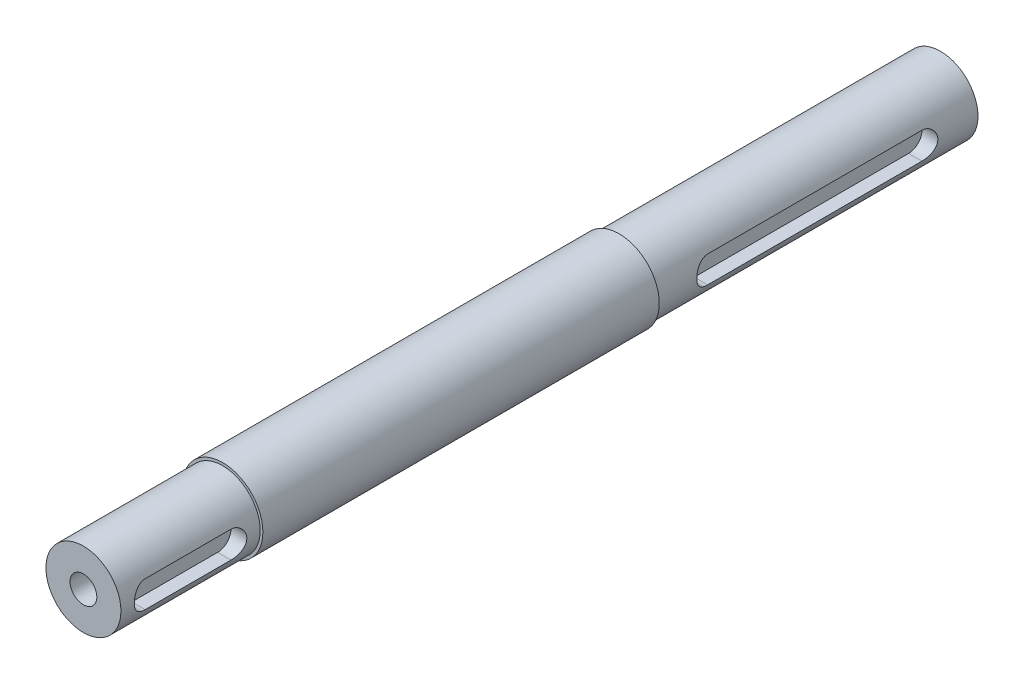
ISO-10303-21;
HEADER;
FILE_DESCRIPTION(('STEP AP214'),'2;1');
FILE_NAME('part.step','',(''),(''),'','','');
FILE_SCHEMA(('AUTOMOTIVE_DESIGN { 1 0 10303 214 1 1 1 1 }'));
ENDSEC;
DATA;
#1=APPLICATION_CONTEXT('core data for automotive mechanical design processes');
#2=APPLICATION_PROTOCOL_DEFINITION('international standard','automotive_design',2000,#1);
#3=PRODUCT_CONTEXT('',#1,'mechanical');
#4=PRODUCT('Part','Part','',(#3));
#5=PRODUCT_RELATED_PRODUCT_CATEGORY('part','',(#4));
#6=PRODUCT_DEFINITION_FORMATION('','',#4);
#7=PRODUCT_DEFINITION_CONTEXT('part definition',#1,'design');
#8=PRODUCT_DEFINITION('design','',#6,#7);
#9=PRODUCT_DEFINITION_SHAPE('','',#8);
#10=(LENGTH_UNIT() NAMED_UNIT(*) SI_UNIT(.MILLI.,.METRE.));
#11=(NAMED_UNIT(*) PLANE_ANGLE_UNIT() SI_UNIT($,.RADIAN.));
#12=(NAMED_UNIT(*) SI_UNIT($,.STERADIAN.) SOLID_ANGLE_UNIT());
#13=UNCERTAINTY_MEASURE_WITH_UNIT(LENGTH_MEASURE(1.E-05),#10,'distance_accuracy_value','');
#14=(GEOMETRIC_REPRESENTATION_CONTEXT(3) GLOBAL_UNCERTAINTY_ASSIGNED_CONTEXT((#13)) GLOBAL_UNIT_ASSIGNED_CONTEXT((#10,
#11,#12)) REPRESENTATION_CONTEXT('',''));
#15=CARTESIAN_POINT('',(0.,0.,0.));
#16=DIRECTION('',(0.,0.,1.));
#17=DIRECTION('',(1.,0.,0.));
#18=AXIS2_PLACEMENT_3D('',#15,#16,#17);
#19=CARTESIAN_POINT('',(0.,0.,134.));
#20=DIRECTION('',(0.,0.,1.));
#21=DIRECTION('',(1.,0.,0.));
#22=AXIS2_PLACEMENT_3D('',#19,#20,#21);
#23=PLANE('',#22);
#24=CARTESIAN_POINT('',(0.,0.,134.));
#25=DIRECTION('',(0.,0.,1.));
#26=DIRECTION('',(1.,0.,0.));
#27=AXIS2_PLACEMENT_3D('',#24,#25,#26);
#28=CIRCLE('',#27,7.5);
#29=CARTESIAN_POINT('',(7.5,0.,134.));
#30=VERTEX_POINT('',#29);
#31=EDGE_CURVE('E176',#30,#30,#28,.T.);
#32=ORIENTED_EDGE('',*,*,#31,.T.);
#33=EDGE_LOOP('',(#32));
#34=FACE_BOUND('',#33,.T.);
#35=CARTESIAN_POINT('',(0.,0.,134.));
#36=DIRECTION('',(0.,0.,1.));
#37=DIRECTION('',(1.,0.,0.));
#38=AXIS2_PLACEMENT_3D('',#35,#36,#37);
#39=CIRCLE('',#38,7.);
#40=CARTESIAN_POINT('',(7.,0.,134.));
#41=VERTEX_POINT('',#40);
#42=EDGE_CURVE('E165',#41,#41,#39,.T.);
#43=ORIENTED_EDGE('',*,*,#42,.F.);
#44=EDGE_LOOP('',(#43));
#45=FACE_BOUND('',#44,.T.);
#46=ADVANCED_FACE('F35',(#34,#45),#23,.T.);
#47=CARTESIAN_POINT('',(0.,0.,60.));
#48=DIRECTION('',(0.,0.,-1.));
#49=DIRECTION('',(-1.,0.,0.));
#50=AXIS2_PLACEMENT_3D('',#47,#48,#49);
#51=CYLINDRICAL_SURFACE('',#50,7.);
#52=DIRECTION('',(0.,0.,-1.));
#53=VECTOR('',#52,1.);
#54=CARTESIAN_POINT('',(6.53834841531101,-2.50000000000001,60.));
#55=LINE('',#54,#53);
#56=CARTESIAN_POINT('',(6.53834841531101,-2.5,10.));
#57=VERTEX_POINT('',#56);
#58=CARTESIAN_POINT('',(6.53834841531101,-2.50000000000001,50.));
#59=VERTEX_POINT('',#58);
#60=EDGE_CURVE('E11',#57,#59,#55,.F.);
#61=ORIENTED_EDGE('',*,*,#60,.T.);
#62=CARTESIAN_POINT('',(6.53834841531101,-2.50000000000001,50.));
#63=CARTESIAN_POINT('',(6.53833653785133,-2.50000932220904,50.0678892457289));
#64=CARTESIAN_POINT('',(6.53940549922738,-2.49723485076694,50.1357719326391));
#65=CARTESIAN_POINT('',(6.54361657478133,-2.4861910211816,50.2710039106114));
#66=CARTESIAN_POINT('',(6.54675805418062,-2.47792334551209,50.3383533586061));
#67=CARTESIAN_POINT('',(6.55501217637942,-2.456001752859,50.4718214146028));
#68=CARTESIAN_POINT('',(6.56011831705676,-2.44236559963955,50.5379433363398));
#69=CARTESIAN_POINT('',(6.57213177854175,-2.40985115466649,50.6687018351085));
#70=CARTESIAN_POINT('',(6.57903917900746,-2.39097263107436,50.7333383463124));
#71=CARTESIAN_POINT('',(6.60214934365709,-2.32673964179205,50.9242643664775));
#72=CARTESIAN_POINT('',(6.62075475340844,-2.27375112606986,51.0477904521356));
#73=CARTESIAN_POINT('',(6.6622539736071,-2.14910757865425,51.284230333128));
#74=CARTESIAN_POINT('',(6.68515090424876,-2.07743895048849,51.3971363167355));
#75=CARTESIAN_POINT('',(6.73379913792224,-1.9140257110197,51.6142152133527));
#76=CARTESIAN_POINT('',(6.75962864041371,-1.82158337146745,51.7178464751959));
#77=CARTESIAN_POINT('',(6.8105759232303,-1.62073388776331,51.9085087047164));
#78=CARTESIAN_POINT('',(6.83569357019868,-1.51232377552674,51.9955365792433));
#79=CARTESIAN_POINT('',(6.88331133279046,-1.27853915335935,52.153089855455));
#80=CARTESIAN_POINT('',(6.90570835223796,-1.15274833789186,52.2230315218605));
#81=CARTESIAN_POINT('',(6.94442357672633,-0.890250825476642,52.3405366467974));
#82=CARTESIAN_POINT('',(6.96074386585465,-0.753547890540333,52.388107779046));
#83=CARTESIAN_POINT('',(6.9849105051071,-0.47882997925618,52.4576406021824));
#84=CARTESIAN_POINT('',(6.99306594352515,-0.341079835227471,52.4805391304711));
#85=CARTESIAN_POINT('',(7.00108798053822,-0.063464305296909,52.5030684027776));
#86=CARTESIAN_POINT('',(7.00095687302702,0.0764004845074428,52.5027055860347));
#87=CARTESIAN_POINT('',(6.99262258049077,0.34759325848694,52.4792887262389));
#88=CARTESIAN_POINT('',(6.98478243583517,0.479022407078714,52.4572552058015));
#89=CARTESIAN_POINT('',(6.96237832507347,0.736175812143601,52.3928265758412));
#90=CARTESIAN_POINT('',(6.94781397899037,0.861899745780458,52.3504303156375));
#91=CARTESIAN_POINT('',(6.91316506890369,1.10616102429807,52.2459530884347));
#92=CARTESIAN_POINT('',(6.89300592164314,1.22457279066906,52.1836042850399));
#93=CARTESIAN_POINT('',(6.84923355616321,1.44953531305523,52.0412206647766));
#94=CARTESIAN_POINT('',(6.82561928959263,1.5560824517677,51.9611804762164));
#95=CARTESIAN_POINT('',(6.7759054780549,1.7603244525607,51.7806767363433));
#96=CARTESIAN_POINT('',(6.74974055843875,1.85724185700417,51.6793502768551));
#97=CARTESIAN_POINT('',(6.69890342468975,2.03299914621296,51.4616726358344));
#98=CARTESIAN_POINT('',(6.67423174765257,2.11183255456462,51.3453160948315));
#99=CARTESIAN_POINT('',(6.62877803875405,2.25049860898458,51.098057401478));
#100=CARTESIAN_POINT('',(6.60807875118994,2.30994207989625,50.9669210244946));
#101=CARTESIAN_POINT('',(6.57388213610267,2.40555439725849,50.6956351984178));
#102=CARTESIAN_POINT('',(6.56037307165054,2.44176119399954,50.555500858831));
#103=CARTESIAN_POINT('',(6.54708542245562,2.47705497148627,50.3449694557358));
#104=CARTESIAN_POINT('',(6.54382010967907,2.48565347586445,50.2762636982282));
#105=CARTESIAN_POINT('',(6.53944910829676,2.49712352174882,50.1383848358083));
#106=CARTESIAN_POINT('',(6.53834103140935,2.50000139665367,50.0692123328995));
#107=CARTESIAN_POINT('',(6.53834841531101,2.5,50.));
#108=B_SPLINE_CURVE_WITH_KNOTS('',3,(#62,#63,#64,#65,#66,#67,#68,#69,#70,#71,#72,#73,#74,#75,
#76,#77,#78,#79,#80,#81,#82,#83,#84,#85,#86,#87,#88,#89,#90,#91,#92,#93,#94,#95,#96,#97,#98,#99,
#100,#101,#102,#103,#104,#105,#106,#107),.UNSPECIFIED.,.F.,.F.,(4,2,2,2,2,2,2,2,2,2,2,2,2,2,2,2,
2,2,2,2,2,2,4),(0.,0.203591628551592,0.407120929225535,0.609982356545748,0.812852756635989,
1.21793118555513,1.6233052814847,2.04515972311929,2.4670926781184,2.9018839896556,
3.33652604665238,3.75400993940862,4.17137826416922,4.56998920861347,4.96862268086888,
5.37284909448639,5.77719841367921,6.20315837945088,6.6292706567472,7.06347329058505,
7.49696496492445,7.70468580162774,7.91217653896404),.UNSPECIFIED.);
#109=CARTESIAN_POINT('',(6.53834841531101,2.5,50.));
#110=VERTEX_POINT('',#109);
#111=EDGE_CURVE('E285',#59,#110,#108,.T.);
#112=ORIENTED_EDGE('',*,*,#111,.T.);
#113=DIRECTION('',(0.,0.,-1.));
#114=VECTOR('',#113,1.);
#115=CARTESIAN_POINT('',(6.53834841531101,2.49999999999999,60.));
#116=LINE('',#115,#114);
#117=CARTESIAN_POINT('',(6.53834841531101,2.49999999999999,10.));
#118=VERTEX_POINT('',#117);
#119=EDGE_CURVE('E44',#110,#118,#116,.T.);
#120=ORIENTED_EDGE('',*,*,#119,.T.);
#121=CARTESIAN_POINT('',(6.53834841531101,2.5,10.));
#122=CARTESIAN_POINT('',(6.53833653785133,2.50000932220903,9.93211075427107));
#123=CARTESIAN_POINT('',(6.53940549922738,2.49723485076694,9.86422806736091));
#124=CARTESIAN_POINT('',(6.54361657478134,2.4861910211816,9.72899608938859));
#125=CARTESIAN_POINT('',(6.54675805418062,2.47792334551208,9.66164664139387));
#126=CARTESIAN_POINT('',(6.55501217637942,2.45600175285899,9.52817858539721));
#127=CARTESIAN_POINT('',(6.56011831705676,2.44236559963954,9.46205666366019));
#128=CARTESIAN_POINT('',(6.57213177854175,2.40985115466648,9.33129816489153));
#129=CARTESIAN_POINT('',(6.57903917900746,2.39097263107435,9.26666165368758));
#130=CARTESIAN_POINT('',(6.6021493436571,2.32673964179204,9.07573563352248));
#131=CARTESIAN_POINT('',(6.62075475340845,2.27375112606986,8.95220954786443));
#132=CARTESIAN_POINT('',(6.6622539736071,2.14910757865425,8.71576966687203));
#133=CARTESIAN_POINT('',(6.68515090424876,2.07743895048849,8.60286368326448));
#134=CARTESIAN_POINT('',(6.73379913792224,1.91402571101969,8.38578478664729));
#135=CARTESIAN_POINT('',(6.75962864041371,1.82158337146744,8.28215352480412));
#136=CARTESIAN_POINT('',(6.81057592323031,1.6207338877633,8.09149129528357));
#137=CARTESIAN_POINT('',(6.83569357019868,1.51232377552673,8.00446342075665));
#138=CARTESIAN_POINT('',(6.88331133279046,1.27853915335934,7.84691014454501));
#139=CARTESIAN_POINT('',(6.90570835223797,1.15274833789185,7.77696847813946));
#140=CARTESIAN_POINT('',(6.94442357672633,0.890250825476632,7.6594633532026));
#141=CARTESIAN_POINT('',(6.96074386585465,0.753547890540324,7.61189222095399));
#142=CARTESIAN_POINT('',(6.9849105051071,0.478829979256173,7.54235939781764));
#143=CARTESIAN_POINT('',(6.99306594352515,0.341079835227464,7.51946086952892));
#144=CARTESIAN_POINT('',(7.00108798053822,0.0634643052969017,7.49693159722236));
#145=CARTESIAN_POINT('',(7.00095687302702,-0.0764004845074502,7.49729441396535));
#146=CARTESIAN_POINT('',(6.99262258049077,-0.347593258486947,7.52071127376112));
#147=CARTESIAN_POINT('',(6.98478243583516,-0.479022407078722,7.54274479419853));
#148=CARTESIAN_POINT('',(6.96237832507347,-0.736175812143609,7.60717342415881));
#149=CARTESIAN_POINT('',(6.94781397899037,-0.861899745780465,7.64956968436252));
#150=CARTESIAN_POINT('',(6.91316506890369,-1.10616102429807,7.75404691156532));
#151=CARTESIAN_POINT('',(6.89300592164314,-1.22457279066906,7.81639571496012));
#152=CARTESIAN_POINT('',(6.8492335561632,-1.44953531305523,7.95877933522336));
#153=CARTESIAN_POINT('',(6.82561928959263,-1.55608245176771,8.0388195237836));
#154=CARTESIAN_POINT('',(6.7759054780549,-1.7603244525607,8.2193232636567));
#155=CARTESIAN_POINT('',(6.74974055843875,-1.85724185700418,8.3206497231449));
#156=CARTESIAN_POINT('',(6.69890342468975,-2.03299914621296,8.53832736416557));
#157=CARTESIAN_POINT('',(6.67423174765257,-2.11183255456462,8.65468390516847));
#158=CARTESIAN_POINT('',(6.62877803875405,-2.25049860898459,8.90194259852198));
#159=CARTESIAN_POINT('',(6.60807875118994,-2.30994207989626,9.03307897550541));
#160=CARTESIAN_POINT('',(6.57388213610267,-2.4055543972585,9.30436480158219));
#161=CARTESIAN_POINT('',(6.56037307165053,-2.44176119399954,9.44449914116898));
#162=CARTESIAN_POINT('',(6.54708542245562,-2.47705497148627,9.65503054426421));
#163=CARTESIAN_POINT('',(6.54382010967907,-2.48565347586445,9.72373630177179));
#164=CARTESIAN_POINT('',(6.53944910829676,-2.49712352174882,9.86161516419169));
#165=CARTESIAN_POINT('',(6.53834103140935,-2.50000139665367,9.93078766710051));
#166=CARTESIAN_POINT('',(6.53834841531101,-2.5,10.));
#167=B_SPLINE_CURVE_WITH_KNOTS('',3,(#121,#122,#123,#124,#125,#126,#127,#128,#129,#130,#131,
#132,#133,#134,#135,#136,#137,#138,#139,#140,#141,#142,#143,#144,#145,#146,#147,#148,#149,#150,
#151,#152,#153,#154,#155,#156,#157,#158,#159,#160,#161,#162,#163,#164,#165,#166),.UNSPECIFIED.,
.F.,.F.,(4,2,2,2,2,2,2,2,2,2,2,2,2,2,2,2,2,2,2,2,2,2,4),(0.,0.203591628551591,0.407120929225529,
0.609982356545743,0.812852756635989,1.21793118555512,1.6233052814847,2.0451597231193,
2.4670926781184,2.90188398965561,3.33652604665238,3.75400993940861,4.17137826416922,
4.56998920861347,4.96862268086888,5.37284909448639,5.77719841367921,6.20315837945088,
6.6292706567472,7.06347329058504,7.49696496492444,7.70468580162772,7.91217653896403),.UNSPECIFIED.);
#168=EDGE_CURVE('E51',#118,#57,#167,.T.);
#169=ORIENTED_EDGE('',*,*,#168,.T.);
#170=EDGE_LOOP('',(#61,#112,#120,#169));
#171=FACE_BOUND('',#170,.T.);
#172=CARTESIAN_POINT('',(0.,0.,60.));
#173=DIRECTION('',(0.,0.,1.));
#174=DIRECTION('',(1.,0.,0.));
#175=AXIS2_PLACEMENT_3D('',#172,#173,#174);
#176=CIRCLE('',#175,7.);
#177=CARTESIAN_POINT('',(7.,0.,60.));
#178=VERTEX_POINT('',#177);
#179=EDGE_CURVE('E185',#178,#178,#176,.T.);
#180=ORIENTED_EDGE('',*,*,#179,.F.);
#181=EDGE_LOOP('',(#180));
#182=FACE_BOUND('',#181,.T.);
#183=CARTESIAN_POINT('',(0.,0.,0.));
#184=DIRECTION('',(0.,0.,1.));
#185=DIRECTION('',(1.,0.,0.));
#186=AXIS2_PLACEMENT_3D('',#183,#184,#185);
#187=CIRCLE('',#186,7.);
#188=CARTESIAN_POINT('',(7.,0.,0.));
#189=VERTEX_POINT('',#188);
#190=EDGE_CURVE('E184',#189,#189,#187,.T.);
#191=ORIENTED_EDGE('',*,*,#190,.T.);
#192=EDGE_LOOP('',(#191));
#193=FACE_BOUND('',#192,.T.);
#194=ADVANCED_FACE('F37',(#171,#182,#193),#51,.T.);
#195=CARTESIAN_POINT('',(0.,0.,0.));
#196=DIRECTION('',(0.,0.,1.));
#197=DIRECTION('',(1.,0.,0.));
#198=AXIS2_PLACEMENT_3D('',#195,#196,#197);
#199=PLANE('',#198);
#200=CARTESIAN_POINT('',(0.,0.,0.));
#201=DIRECTION('',(0.,0.,-1.));
#202=DIRECTION('',(-1.,0.,0.));
#203=AXIS2_PLACEMENT_3D('',#200,#201,#202);
#204=CIRCLE('',#203,2.5);
#205=CARTESIAN_POINT('',(-2.5,0.,0.));
#206=VERTEX_POINT('',#205);
#207=EDGE_CURVE('E117',#206,#206,#204,.T.);
#208=ORIENTED_EDGE('',*,*,#207,.F.);
#209=EDGE_LOOP('',(#208));
#210=FACE_BOUND('',#209,.T.);
#211=ORIENTED_EDGE('',*,*,#190,.F.);
#212=EDGE_LOOP('',(#211));
#213=FACE_BOUND('',#212,.T.);
#214=ADVANCED_FACE('F237',(#210,#213),#199,.F.);
#215=CARTESIAN_POINT('',(0.,0.,60.));
#216=DIRECTION('',(0.,0.,1.));
#217=DIRECTION('',(1.,0.,0.));
#218=AXIS2_PLACEMENT_3D('',#215,#216,#217);
#219=PLANE('',#218);
#220=CARTESIAN_POINT('',(0.,0.,60.));
#221=DIRECTION('',(0.,0.,1.));
#222=DIRECTION('',(1.,0.,0.));
#223=AXIS2_PLACEMENT_3D('',#220,#221,#222);
#224=CIRCLE('',#223,7.5);
#225=CARTESIAN_POINT('',(7.5,0.,60.));
#226=VERTEX_POINT('',#225);
#227=EDGE_CURVE('E181',#226,#226,#224,.T.);
#228=ORIENTED_EDGE('',*,*,#227,.F.);
#229=EDGE_LOOP('',(#228));
#230=FACE_BOUND('',#229,.T.);
#231=ORIENTED_EDGE('',*,*,#179,.T.);
#232=EDGE_LOOP('',(#231));
#233=FACE_BOUND('',#232,.T.);
#234=ADVANCED_FACE('F241',(#230,#233),#219,.F.);
#235=CARTESIAN_POINT('',(0.,0.,122.));
#236=DIRECTION('',(0.,0.,-1.));
#237=DIRECTION('',(-1.,0.,0.));
#238=AXIS2_PLACEMENT_3D('',#235,#236,#237);
#239=CYLINDRICAL_SURFACE('',#238,7.5);
#240=ORIENTED_EDGE('',*,*,#227,.T.);
#241=EDGE_LOOP('',(#240));
#242=FACE_BOUND('',#241,.T.);
#243=ORIENTED_EDGE('',*,*,#31,.F.);
#244=EDGE_LOOP('',(#243));
#245=FACE_BOUND('',#244,.T.);
#246=ADVANCED_FACE('F228',(#242,#245),#239,.T.);
#247=CARTESIAN_POINT('',(0.,0.,160.));
#248=DIRECTION('',(0.,0.,-1.));
#249=DIRECTION('',(-1.,0.,0.));
#250=AXIS2_PLACEMENT_3D('',#247,#248,#249);
#251=CYLINDRICAL_SURFACE('',#250,7.);
#252=DIRECTION('',(0.,0.,-1.));
#253=VECTOR('',#252,1.);
#254=CARTESIAN_POINT('',(6.53834841531101,2.5,160.));
#255=LINE('',#254,#253);
#256=CARTESIAN_POINT('',(6.53834841531101,2.5,155.));
#257=VERTEX_POINT('',#256);
#258=CARTESIAN_POINT('',(6.53834841531101,2.5,139.));
#259=VERTEX_POINT('',#258);
#260=EDGE_CURVE('E292',#257,#259,#255,.T.);
#261=ORIENTED_EDGE('',*,*,#260,.T.);
#262=CARTESIAN_POINT('',(6.53834841531101,2.5,139.));
#263=CARTESIAN_POINT('',(6.53833653785133,2.50000932220903,138.932110754271));
#264=CARTESIAN_POINT('',(6.53940549922738,2.49723485076694,138.864228067361));
#265=CARTESIAN_POINT('',(6.54361657478134,2.4861910211816,138.728996089389));
#266=CARTESIAN_POINT('',(6.54675805418062,2.47792334551208,138.661646641394));
#267=CARTESIAN_POINT('',(6.55501217637942,2.456001752859,138.528178585397));
#268=CARTESIAN_POINT('',(6.56011831705676,2.44236559963955,138.46205666366));
#269=CARTESIAN_POINT('',(6.57213177854175,2.40985115466648,138.331298164892));
#270=CARTESIAN_POINT('',(6.57903917900746,2.39097263107436,138.266661653688));
#271=CARTESIAN_POINT('',(6.60214934365709,2.32673964179205,138.075735633523));
#272=CARTESIAN_POINT('',(6.62075475340844,2.27375112606987,137.952209547864));
#273=CARTESIAN_POINT('',(6.6622539736071,2.14910757865425,137.715769666872));
#274=CARTESIAN_POINT('',(6.68515090424876,2.07743895048849,137.602863683265));
#275=CARTESIAN_POINT('',(6.73379913792224,1.9140257110197,137.385784786647));
#276=CARTESIAN_POINT('',(6.75962864041371,1.82158337146744,137.282153524804));
#277=CARTESIAN_POINT('',(6.81057592323031,1.6207338877633,137.091491295284));
#278=CARTESIAN_POINT('',(6.83569357019868,1.51232377552674,137.004463420757));
#279=CARTESIAN_POINT('',(6.88331133279046,1.27853915335935,136.846910144545));
#280=CARTESIAN_POINT('',(6.90570835223797,1.15274833789186,136.776968478139));
#281=CARTESIAN_POINT('',(6.94442357672633,0.890250825476646,136.659463353203));
#282=CARTESIAN_POINT('',(6.96074386585465,0.75354789054034,136.611892220954));
#283=CARTESIAN_POINT('',(6.9849105051071,0.478829979256191,136.542359397818));
#284=CARTESIAN_POINT('',(6.99306594352515,0.341079835227484,136.519460869529));
#285=CARTESIAN_POINT('',(7.00108798053822,0.0634643052969198,136.496931597222));
#286=CARTESIAN_POINT('',(7.00095687302702,-0.076400484507434,136.497294413965));
#287=CARTESIAN_POINT('',(6.99262258049077,-0.347593258486933,136.520711273761));
#288=CARTESIAN_POINT('',(6.98478243583517,-0.479022407078707,136.542744794199));
#289=CARTESIAN_POINT('',(6.96237832507347,-0.736175812143594,136.607173424159));
#290=CARTESIAN_POINT('',(6.94781397899037,-0.86189974578045,136.649569684363));
#291=CARTESIAN_POINT('',(6.91316506890369,-1.10616102429805,136.754046911565));
#292=CARTESIAN_POINT('',(6.89300592164314,-1.22457279066904,136.81639571496));
#293=CARTESIAN_POINT('',(6.84923355616321,-1.44953531305521,136.958779335223));
#294=CARTESIAN_POINT('',(6.82561928959264,-1.55608245176768,137.038819523784));
#295=CARTESIAN_POINT('',(6.7759054780549,-1.76032445256068,137.219323263657));
#296=CARTESIAN_POINT('',(6.74974055843876,-1.85724185700416,137.320649723145));
#297=CARTESIAN_POINT('',(6.69890342468976,-2.03299914621295,137.538327364166));
#298=CARTESIAN_POINT('',(6.67423174765257,-2.11183255456461,137.654683905168));
#299=CARTESIAN_POINT('',(6.62877803875405,-2.25049860898458,137.901942598522));
#300=CARTESIAN_POINT('',(6.60807875118995,-2.30994207989624,138.033078975505));
#301=CARTESIAN_POINT('',(6.57388213610267,-2.40555439725849,138.304364801582));
#302=CARTESIAN_POINT('',(6.56037307165054,-2.44176119399953,138.444499141169));
#303=CARTESIAN_POINT('',(6.54708542245562,-2.47705497148627,138.655030544264));
#304=CARTESIAN_POINT('',(6.54382010967907,-2.48565347586445,138.723736301772));
#305=CARTESIAN_POINT('',(6.53944910829676,-2.49712352174882,138.861615164192));
#306=CARTESIAN_POINT('',(6.53834103140935,-2.50000139665368,138.930787667101));
#307=CARTESIAN_POINT('',(6.53834841531101,-2.5,139.));
#308=B_SPLINE_CURVE_WITH_KNOTS('',3,(#262,#263,#264,#265,#266,#267,#268,#269,#270,#271,#272,
#273,#274,#275,#276,#277,#278,#279,#280,#281,#282,#283,#284,#285,#286,#287,#288,#289,#290,#291,
#292,#293,#294,#295,#296,#297,#298,#299,#300,#301,#302,#303,#304,#305,#306,#307),.UNSPECIFIED.,
.F.,.F.,(4,2,2,2,2,2,2,2,2,2,2,2,2,2,2,2,2,2,2,2,2,2,4),(0.,0.203591628551585,0.407120929225507,
0.609982356545727,0.812852756635974,1.21793118555512,1.62330528148469,2.0451597231193,
2.46709267811838,2.9018839896556,3.33652604665236,3.7540099394086,4.17137826416921,
4.56998920861346,4.96862268086886,5.37284909448636,5.7771984136792,6.20315837945086,
6.62927065674717,7.06347329058501,7.49696496492443,7.70468580162773,7.91217653896406),.UNSPECIFIED.);
#309=CARTESIAN_POINT('',(6.53834841531101,-2.5,139.));
#310=VERTEX_POINT('',#309);
#311=EDGE_CURVE('E188',#259,#310,#308,.T.);
#312=ORIENTED_EDGE('',*,*,#311,.T.);
#313=DIRECTION('',(0.,0.,-1.));
#314=VECTOR('',#313,1.);
#315=CARTESIAN_POINT('',(6.53834841531101,-2.5,160.));
#316=LINE('',#315,#314);
#317=CARTESIAN_POINT('',(6.53834841531101,-2.5,155.));
#318=VERTEX_POINT('',#317);
#319=EDGE_CURVE('E307',#310,#318,#316,.F.);
#320=ORIENTED_EDGE('',*,*,#319,.T.);
#321=CARTESIAN_POINT('',(6.53834841531101,-2.5,155.));
#322=CARTESIAN_POINT('',(6.53833653785133,-2.50000932220903,155.067889245729));
#323=CARTESIAN_POINT('',(6.53940549922738,-2.49723485076694,155.135771932639));
#324=CARTESIAN_POINT('',(6.54361657478133,-2.4861910211816,155.271003910611));
#325=CARTESIAN_POINT('',(6.54675805418062,-2.47792334551209,155.338353358606));
#326=CARTESIAN_POINT('',(6.55501217637942,-2.45600175285901,155.471821414603));
#327=CARTESIAN_POINT('',(6.56011831705675,-2.44236559963956,155.53794333634));
#328=CARTESIAN_POINT('',(6.57213177854174,-2.4098511546665,155.668701835108));
#329=CARTESIAN_POINT('',(6.57903917900746,-2.39097263107437,155.733338346312));
#330=CARTESIAN_POINT('',(6.60214934365709,-2.32673964179205,155.924264366478));
#331=CARTESIAN_POINT('',(6.62075475340844,-2.27375112606987,156.047790452136));
#332=CARTESIAN_POINT('',(6.6622539736071,-2.14910757865425,156.284230333128));
#333=CARTESIAN_POINT('',(6.68515090424876,-2.07743895048849,156.397136316736));
#334=CARTESIAN_POINT('',(6.73379913792224,-1.9140257110197,156.614215213353));
#335=CARTESIAN_POINT('',(6.75962864041371,-1.82158337146744,156.717846475196));
#336=CARTESIAN_POINT('',(6.8105759232303,-1.62073388776331,156.908508704716));
#337=CARTESIAN_POINT('',(6.83569357019868,-1.51232377552674,156.995536579243));
#338=CARTESIAN_POINT('',(6.88331133279046,-1.27853915335936,157.153089855455));
#339=CARTESIAN_POINT('',(6.90570835223796,-1.15274833789187,157.223031521861));
#340=CARTESIAN_POINT('',(6.94442357672633,-0.890250825476652,157.340536646797));
#341=CARTESIAN_POINT('',(6.96074386585465,-0.753547890540343,157.388107779046));
#342=CARTESIAN_POINT('',(6.9849105051071,-0.47882997925619,157.457640602182));
#343=CARTESIAN_POINT('',(6.99306594352515,-0.341079835227481,157.480539130471));
#344=CARTESIAN_POINT('',(7.00108798053822,-0.0634643052969172,157.503068402778));
#345=CARTESIAN_POINT('',(7.00095687302702,0.0764004845074361,157.502705586035));
#346=CARTESIAN_POINT('',(6.99262258049077,0.347593258486934,157.479288726239));
#347=CARTESIAN_POINT('',(6.98478243583517,0.479022407078707,157.457255205801));
#348=CARTESIAN_POINT('',(6.96237832507347,0.736175812143595,157.392826575841));
#349=CARTESIAN_POINT('',(6.94781397899037,0.861899745780453,157.350430315638));
#350=CARTESIAN_POINT('',(6.91316506890369,1.10616102429806,157.245953088435));
#351=CARTESIAN_POINT('',(6.89300592164314,1.22457279066905,157.18360428504));
#352=CARTESIAN_POINT('',(6.84923355616321,1.44953531305522,157.041220664777));
#353=CARTESIAN_POINT('',(6.82561928959263,1.55608245176769,156.961180476216));
#354=CARTESIAN_POINT('',(6.7759054780549,1.76032445256068,156.780676736343));
#355=CARTESIAN_POINT('',(6.74974055843876,1.85724185700416,156.679350276855));
#356=CARTESIAN_POINT('',(6.69890342468976,2.03299914621295,156.461672635834));
#357=CARTESIAN_POINT('',(6.67423174765257,2.11183255456461,156.345316094832));
#358=CARTESIAN_POINT('',(6.62877803875405,2.25049860898458,156.098057401478));
#359=CARTESIAN_POINT('',(6.60807875118995,2.30994207989624,155.966921024495));
#360=CARTESIAN_POINT('',(6.57388213610267,2.40555439725849,155.695635198418));
#361=CARTESIAN_POINT('',(6.56037307165054,2.44176119399953,155.555500858831));
#362=CARTESIAN_POINT('',(6.54708542245562,2.47705497148627,155.344969455736));
#363=CARTESIAN_POINT('',(6.54382010967907,2.48565347586445,155.276263698228));
#364=CARTESIAN_POINT('',(6.53944910829676,2.49712352174882,155.138384835808));
#365=CARTESIAN_POINT('',(6.53834103140935,2.50000139665368,155.069212332899));
#366=CARTESIAN_POINT('',(6.53834841531101,2.5,155.));
#367=B_SPLINE_CURVE_WITH_KNOTS('',3,(#321,#322,#323,#324,#325,#326,#327,#328,#329,#330,#331,
#332,#333,#334,#335,#336,#337,#338,#339,#340,#341,#342,#343,#344,#345,#346,#347,#348,#349,#350,
#351,#352,#353,#354,#355,#356,#357,#358,#359,#360,#361,#362,#363,#364,#365,#366),.UNSPECIFIED.,
.F.,.F.,(4,2,2,2,2,2,2,2,2,2,2,2,2,2,2,2,2,2,2,2,2,2,4),(0.,0.203591628551557,0.407120929225478,
0.609982356545669,0.812852756635974,1.21793118555512,1.62330528148469,2.04515972311928,
2.46709267811838,2.90188398965559,3.33652604665236,3.7540099394086,4.17137826416921,
4.56998920861346,4.96862268086886,5.37284909448638,5.7771984136792,6.20315837945085,
6.62927065674716,7.06347329058501,7.49696496492443,7.70468580162773,7.91217653896406),.UNSPECIFIED.);
#368=EDGE_CURVE('E59',#318,#257,#367,.T.);
#369=ORIENTED_EDGE('',*,*,#368,.T.);
#370=EDGE_LOOP('',(#261,#312,#320,#369));
#371=FACE_BOUND('',#370,.T.);
#372=CARTESIAN_POINT('',(0.,0.,160.));
#373=DIRECTION('',(0.,0.,1.));
#374=DIRECTION('',(1.,0.,0.));
#375=AXIS2_PLACEMENT_3D('',#372,#373,#374);
#376=CIRCLE('',#375,7.);
#377=CARTESIAN_POINT('',(7.,0.,160.));
#378=VERTEX_POINT('',#377);
#379=EDGE_CURVE('E173',#378,#378,#376,.T.);
#380=ORIENTED_EDGE('',*,*,#379,.F.);
#381=EDGE_LOOP('',(#380));
#382=FACE_BOUND('',#381,.T.);
#383=ORIENTED_EDGE('',*,*,#42,.T.);
#384=EDGE_LOOP('',(#383));
#385=FACE_BOUND('',#384,.T.);
#386=ADVANCED_FACE('F203',(#371,#382,#385),#251,.T.);
#387=CARTESIAN_POINT('',(0.,0.,160.));
#388=DIRECTION('',(0.,0.,1.));
#389=DIRECTION('',(1.,0.,0.));
#390=AXIS2_PLACEMENT_3D('',#387,#388,#389);
#391=PLANE('',#390);
#392=CARTESIAN_POINT('',(0.,0.,160.));
#393=DIRECTION('',(0.,0.,1.));
#394=DIRECTION('',(1.,0.,0.));
#395=AXIS2_PLACEMENT_3D('',#392,#393,#394);
#396=CIRCLE('',#395,2.49999999999999);
#397=CARTESIAN_POINT('',(2.49999999999999,0.,160.));
#398=VERTEX_POINT('',#397);
#399=EDGE_CURVE('E118',#398,#398,#396,.T.);
#400=ORIENTED_EDGE('',*,*,#399,.F.);
#401=EDGE_LOOP('',(#400));
#402=FACE_BOUND('',#401,.T.);
#403=ORIENTED_EDGE('',*,*,#379,.T.);
#404=EDGE_LOOP('',(#403));
#405=FACE_BOUND('',#404,.T.);
#406=ADVANCED_FACE('F222',(#402,#405),#391,.T.);
#407=CARTESIAN_POINT('',(4.04,0.,155.));
#408=DIRECTION('',(1.,0.,0.));
#409=DIRECTION('',(0.,0.,-1.));
#410=AXIS2_PLACEMENT_3D('',#407,#408,#409);
#411=CYLINDRICAL_SURFACE('',#410,2.5);
#412=DIRECTION('',(1.,0.,0.));
#413=VECTOR('',#412,1.);
#414=CARTESIAN_POINT('',(4.04,-2.5,155.));
#415=LINE('',#414,#413);
#416=CARTESIAN_POINT('',(4.04,-2.5,155.));
#417=VERTEX_POINT('',#416);
#418=EDGE_CURVE('E162',#417,#318,#415,.T.);
#419=ORIENTED_EDGE('',*,*,#418,.F.);
#420=CARTESIAN_POINT('',(4.04,0.,155.));
#421=DIRECTION('',(1.,0.,0.));
#422=DIRECTION('',(0.,0.,-1.));
#423=AXIS2_PLACEMENT_3D('',#420,#421,#422);
#424=CIRCLE('',#423,2.5);
#425=CARTESIAN_POINT('',(4.04,2.5,155.));
#426=VERTEX_POINT('',#425);
#427=EDGE_CURVE('E143',#426,#417,#424,.T.);
#428=ORIENTED_EDGE('',*,*,#427,.F.);
#429=DIRECTION('',(1.,0.,0.));
#430=VECTOR('',#429,1.);
#431=CARTESIAN_POINT('',(4.04,2.5,155.));
#432=LINE('',#431,#430);
#433=EDGE_CURVE('E163',#426,#257,#432,.T.);
#434=ORIENTED_EDGE('',*,*,#433,.T.);
#435=ORIENTED_EDGE('',*,*,#368,.F.);
#436=EDGE_LOOP('',(#419,#428,#434,#435));
#437=FACE_BOUND('',#436,.T.);
#438=ADVANCED_FACE('F219',(#437),#411,.F.);
#439=CARTESIAN_POINT('',(4.04,2.5,155.));
#440=DIRECTION('',(0.,1.,0.));
#441=DIRECTION('',(0.,0.,1.));
#442=AXIS2_PLACEMENT_3D('',#439,#440,#441);
#443=PLANE('',#442);
#444=ORIENTED_EDGE('',*,*,#433,.F.);
#445=DIRECTION('',(0.,0.,1.));
#446=VECTOR('',#445,1.);
#447=CARTESIAN_POINT('',(4.04,2.5,155.));
#448=LINE('',#447,#446);
#449=CARTESIAN_POINT('',(4.04,2.5,139.));
#450=VERTEX_POINT('',#449);
#451=EDGE_CURVE('E159',#450,#426,#448,.T.);
#452=ORIENTED_EDGE('',*,*,#451,.F.);
#453=DIRECTION('',(1.,0.,0.));
#454=VECTOR('',#453,1.);
#455=CARTESIAN_POINT('',(4.04,2.5,139.));
#456=LINE('',#455,#454);
#457=EDGE_CURVE('E166',#450,#259,#456,.T.);
#458=ORIENTED_EDGE('',*,*,#457,.T.);
#459=ORIENTED_EDGE('',*,*,#260,.F.);
#460=EDGE_LOOP('',(#444,#452,#458,#459));
#461=FACE_BOUND('',#460,.T.);
#462=ADVANCED_FACE('F213',(#461),#443,.F.);
#463=CARTESIAN_POINT('',(4.04,0.,139.));
#464=DIRECTION('',(1.,0.,0.));
#465=DIRECTION('',(0.,0.,-1.));
#466=AXIS2_PLACEMENT_3D('',#463,#464,#465);
#467=CYLINDRICAL_SURFACE('',#466,2.5);
#468=ORIENTED_EDGE('',*,*,#457,.F.);
#469=CARTESIAN_POINT('',(4.04,0.,139.));
#470=DIRECTION('',(1.,0.,0.));
#471=DIRECTION('',(0.,0.,-1.));
#472=AXIS2_PLACEMENT_3D('',#469,#470,#471);
#473=CIRCLE('',#472,2.5);
#474=CARTESIAN_POINT('',(4.04,-2.5,139.));
#475=VERTEX_POINT('',#474);
#476=EDGE_CURVE('E156',#475,#450,#473,.T.);
#477=ORIENTED_EDGE('',*,*,#476,.F.);
#478=DIRECTION('',(1.,0.,0.));
#479=VECTOR('',#478,1.);
#480=CARTESIAN_POINT('',(4.04,-2.5,139.));
#481=LINE('',#480,#479);
#482=EDGE_CURVE('E169',#475,#310,#481,.T.);
#483=ORIENTED_EDGE('',*,*,#482,.T.);
#484=ORIENTED_EDGE('',*,*,#311,.F.);
#485=EDGE_LOOP('',(#468,#477,#483,#484));
#486=FACE_BOUND('',#485,.T.);
#487=ADVANCED_FACE('F207',(#486),#467,.F.);
#488=CARTESIAN_POINT('',(4.04,-2.5,155.));
#489=DIRECTION('',(0.,-1.,0.));
#490=DIRECTION('',(0.,0.,-1.));
#491=AXIS2_PLACEMENT_3D('',#488,#489,#490);
#492=PLANE('',#491);
#493=ORIENTED_EDGE('',*,*,#482,.F.);
#494=DIRECTION('',(0.,0.,-1.));
#495=VECTOR('',#494,1.);
#496=CARTESIAN_POINT('',(4.04,-2.5,155.));
#497=LINE('',#496,#495);
#498=EDGE_CURVE('E153',#417,#475,#497,.T.);
#499=ORIENTED_EDGE('',*,*,#498,.F.);
#500=ORIENTED_EDGE('',*,*,#418,.T.);
#501=ORIENTED_EDGE('',*,*,#319,.F.);
#502=EDGE_LOOP('',(#493,#499,#500,#501));
#503=FACE_BOUND('',#502,.T.);
#504=ADVANCED_FACE('F212',(#503),#492,.F.);
#505=CARTESIAN_POINT('',(4.04,0.,155.));
#506=DIRECTION('',(1.,0.,0.));
#507=DIRECTION('',(0.,0.,-1.));
#508=AXIS2_PLACEMENT_3D('',#505,#506,#507);
#509=PLANE('',#508);
#510=ORIENTED_EDGE('',*,*,#427,.T.);
#511=ORIENTED_EDGE('',*,*,#498,.T.);
#512=ORIENTED_EDGE('',*,*,#476,.T.);
#513=ORIENTED_EDGE('',*,*,#451,.T.);
#514=EDGE_LOOP('',(#510,#511,#512,#513));
#515=FACE_BOUND('',#514,.T.);
#516=ADVANCED_FACE('F217',(#515),#509,.T.);
#517=CARTESIAN_POINT('',(4.04,0.,10.));
#518=DIRECTION('',(1.,0.,0.));
#519=DIRECTION('',(0.,0.,-1.));
#520=AXIS2_PLACEMENT_3D('',#517,#518,#519);
#521=CYLINDRICAL_SURFACE('',#520,2.5);
#522=DIRECTION('',(1.,0.,0.));
#523=VECTOR('',#522,1.);
#524=CARTESIAN_POINT('',(4.04,2.5,10.));
#525=LINE('',#524,#523);
#526=CARTESIAN_POINT('',(4.04,2.5,10.));
#527=VERTEX_POINT('',#526);
#528=EDGE_CURVE('E140',#527,#118,#525,.T.);
#529=ORIENTED_EDGE('',*,*,#528,.F.);
#530=CARTESIAN_POINT('',(4.04,0.,10.));
#531=DIRECTION('',(1.,0.,0.));
#532=DIRECTION('',(0.,0.,-1.));
#533=AXIS2_PLACEMENT_3D('',#530,#531,#532);
#534=CIRCLE('',#533,2.5);
#535=CARTESIAN_POINT('',(4.04,-2.5,10.));
#536=VERTEX_POINT('',#535);
#537=EDGE_CURVE('E128',#536,#527,#534,.T.);
#538=ORIENTED_EDGE('',*,*,#537,.F.);
#539=DIRECTION('',(1.,0.,0.));
#540=VECTOR('',#539,1.);
#541=CARTESIAN_POINT('',(4.04,-2.5,10.));
#542=LINE('',#541,#540);
#543=EDGE_CURVE('E141',#536,#57,#542,.T.);
#544=ORIENTED_EDGE('',*,*,#543,.T.);
#545=ORIENTED_EDGE('',*,*,#168,.F.);
#546=EDGE_LOOP('',(#529,#538,#544,#545));
#547=FACE_BOUND('',#546,.T.);
#548=ADVANCED_FACE('F277',(#547),#521,.F.);
#549=CARTESIAN_POINT('',(4.04,-2.5,10.));
#550=DIRECTION('',(0.,-1.,0.));
#551=DIRECTION('',(0.,0.,-1.));
#552=AXIS2_PLACEMENT_3D('',#549,#550,#551);
#553=PLANE('',#552);
#554=ORIENTED_EDGE('',*,*,#543,.F.);
#555=DIRECTION('',(0.,0.,-1.));
#556=VECTOR('',#555,1.);
#557=CARTESIAN_POINT('',(4.04,-2.5,10.));
#558=LINE('',#557,#556);
#559=CARTESIAN_POINT('',(4.04,-2.50000000000001,50.));
#560=VERTEX_POINT('',#559);
#561=EDGE_CURVE('E137',#560,#536,#558,.T.);
#562=ORIENTED_EDGE('',*,*,#561,.F.);
#563=DIRECTION('',(1.,0.,0.));
#564=VECTOR('',#563,1.);
#565=CARTESIAN_POINT('',(4.04,-2.50000000000001,50.));
#566=LINE('',#565,#564);
#567=EDGE_CURVE('E144',#560,#59,#566,.T.);
#568=ORIENTED_EDGE('',*,*,#567,.T.);
#569=ORIENTED_EDGE('',*,*,#60,.F.);
#570=EDGE_LOOP('',(#554,#562,#568,#569));
#571=FACE_BOUND('',#570,.T.);
#572=ADVANCED_FACE('F273',(#571),#553,.F.);
#573=CARTESIAN_POINT('',(4.04,0.,50.));
#574=DIRECTION('',(1.,0.,0.));
#575=DIRECTION('',(0.,0.,-1.));
#576=AXIS2_PLACEMENT_3D('',#573,#574,#575);
#577=CYLINDRICAL_SURFACE('',#576,2.5);
#578=ORIENTED_EDGE('',*,*,#567,.F.);
#579=CARTESIAN_POINT('',(4.04,0.,50.));
#580=DIRECTION('',(1.,0.,0.));
#581=DIRECTION('',(0.,0.,-1.));
#582=AXIS2_PLACEMENT_3D('',#579,#580,#581);
#583=CIRCLE('',#582,2.5);
#584=CARTESIAN_POINT('',(4.04,2.5,50.));
#585=VERTEX_POINT('',#584);
#586=EDGE_CURVE('E134',#585,#560,#583,.T.);
#587=ORIENTED_EDGE('',*,*,#586,.F.);
#588=DIRECTION('',(1.,0.,0.));
#589=VECTOR('',#588,1.);
#590=CARTESIAN_POINT('',(4.04,2.5,50.));
#591=LINE('',#590,#589);
#592=EDGE_CURVE('E147',#585,#110,#591,.T.);
#593=ORIENTED_EDGE('',*,*,#592,.T.);
#594=ORIENTED_EDGE('',*,*,#111,.F.);
#595=EDGE_LOOP('',(#578,#587,#593,#594));
#596=FACE_BOUND('',#595,.T.);
#597=ADVANCED_FACE('F276',(#596),#577,.F.);
#598=CARTESIAN_POINT('',(4.04,2.5,10.));
#599=DIRECTION('',(0.,1.,0.));
#600=DIRECTION('',(0.,0.,1.));
#601=AXIS2_PLACEMENT_3D('',#598,#599,#600);
#602=PLANE('',#601);
#603=ORIENTED_EDGE('',*,*,#592,.F.);
#604=DIRECTION('',(0.,0.,1.));
#605=VECTOR('',#604,1.);
#606=CARTESIAN_POINT('',(4.04,2.5,10.));
#607=LINE('',#606,#605);
#608=EDGE_CURVE('E131',#527,#585,#607,.T.);
#609=ORIENTED_EDGE('',*,*,#608,.F.);
#610=ORIENTED_EDGE('',*,*,#528,.T.);
#611=ORIENTED_EDGE('',*,*,#119,.F.);
#612=EDGE_LOOP('',(#603,#609,#610,#611));
#613=FACE_BOUND('',#612,.T.);
#614=ADVANCED_FACE('F271',(#613),#602,.F.);
#615=CARTESIAN_POINT('',(4.04,0.,10.));
#616=DIRECTION('',(1.,0.,0.));
#617=DIRECTION('',(0.,0.,-1.));
#618=AXIS2_PLACEMENT_3D('',#615,#616,#617);
#619=PLANE('',#618);
#620=ORIENTED_EDGE('',*,*,#537,.T.);
#621=ORIENTED_EDGE('',*,*,#608,.T.);
#622=ORIENTED_EDGE('',*,*,#586,.T.);
#623=ORIENTED_EDGE('',*,*,#561,.T.);
#624=EDGE_LOOP('',(#620,#621,#622,#623));
#625=FACE_BOUND('',#624,.T.);
#626=ADVANCED_FACE('F263',(#625),#619,.T.);
#627=CARTESIAN_POINT('',(0.,0.,15.));
#628=DIRECTION('',(0.,0.,-1.));
#629=DIRECTION('',(-1.,0.,0.));
#630=AXIS2_PLACEMENT_3D('',#627,#628,#629);
#631=CONICAL_SURFACE('',#630,2.5,1.02974425867665);
#632=CARTESIAN_POINT('',(0.,0.,16.5021515475689));
#633=VERTEX_POINT('',#632);
#634=VERTEX_LOOP('',#633);
#635=FACE_BOUND('',#634,.T.);
#636=CARTESIAN_POINT('',(0.,0.,15.));
#637=DIRECTION('',(0.,0.,-1.));
#638=DIRECTION('',(-1.,0.,0.));
#639=AXIS2_PLACEMENT_3D('',#636,#637,#638);
#640=CIRCLE('',#639,2.5);
#641=CARTESIAN_POINT('',(-2.5,0.,15.));
#642=VERTEX_POINT('',#641);
#643=EDGE_CURVE('E121',#642,#642,#640,.T.);
#644=ORIENTED_EDGE('',*,*,#643,.T.);
#645=EDGE_LOOP('',(#644));
#646=FACE_BOUND('',#645,.T.);
#647=ADVANCED_FACE('F257',(#635,#646),#631,.F.);
#648=CARTESIAN_POINT('',(0.,0.,0.));
#649=DIRECTION('',(0.,0.,-1.));
#650=DIRECTION('',(-1.,0.,0.));
#651=AXIS2_PLACEMENT_3D('',#648,#649,#650);
#652=CYLINDRICAL_SURFACE('',#651,2.5);
#653=ORIENTED_EDGE('',*,*,#643,.F.);
#654=EDGE_LOOP('',(#653));
#655=FACE_BOUND('',#654,.T.);
#656=ORIENTED_EDGE('',*,*,#207,.T.);
#657=EDGE_LOOP('',(#656));
#658=FACE_BOUND('',#657,.T.);
#659=ADVANCED_FACE('F111',(#655,#658),#652,.F.);
#660=CARTESIAN_POINT('',(0.,0.,145.));
#661=DIRECTION('',(0.,0.,1.));
#662=DIRECTION('',(1.,0.,0.));
#663=AXIS2_PLACEMENT_3D('',#660,#661,#662);
#664=CONICAL_SURFACE('',#663,2.5,1.02974425867665);
#665=CARTESIAN_POINT('',(0.,0.,143.497848452431));
#666=VERTEX_POINT('',#665);
#667=VERTEX_LOOP('',#666);
#668=FACE_BOUND('',#667,.T.);
#669=CARTESIAN_POINT('',(0.,0.,145.));
#670=DIRECTION('',(0.,0.,1.));
#671=DIRECTION('',(1.,0.,0.));
#672=AXIS2_PLACEMENT_3D('',#669,#670,#671);
#673=CIRCLE('',#672,2.5);
#674=CARTESIAN_POINT('',(2.5,0.,145.));
#675=VERTEX_POINT('',#674);
#676=EDGE_CURVE('E115',#675,#675,#673,.T.);
#677=ORIENTED_EDGE('',*,*,#676,.T.);
#678=EDGE_LOOP('',(#677));
#679=FACE_BOUND('',#678,.T.);
#680=ADVANCED_FACE('F107',(#668,#679),#664,.F.);
#681=CARTESIAN_POINT('',(0.,0.,160.));
#682=DIRECTION('',(0.,0.,1.));
#683=DIRECTION('',(1.,0.,0.));
#684=AXIS2_PLACEMENT_3D('',#681,#682,#683);
#685=CYLINDRICAL_SURFACE('',#684,2.49999999999999);
#686=ORIENTED_EDGE('',*,*,#676,.F.);
#687=EDGE_LOOP('',(#686));
#688=FACE_BOUND('',#687,.T.);
#689=ORIENTED_EDGE('',*,*,#399,.T.);
#690=EDGE_LOOP('',(#689));
#691=FACE_BOUND('',#690,.T.);
#692=ADVANCED_FACE('F110',(#688,#691),#685,.F.);
#693=CLOSED_SHELL('',(#46,#194,#214,#234,#246,#386,#406,#438,#462,#487,#504,#516,#548,#572,#597,
#614,#626,#647,#659,#680,#692));
#694=MANIFOLD_SOLID_BREP('B2',#693);
#695=ADVANCED_BREP_SHAPE_REPRESENTATION('',(#18,#694),#14);
#696=SHAPE_DEFINITION_REPRESENTATION(#9,#695);
ENDSEC;
END-ISO-10303-21;
